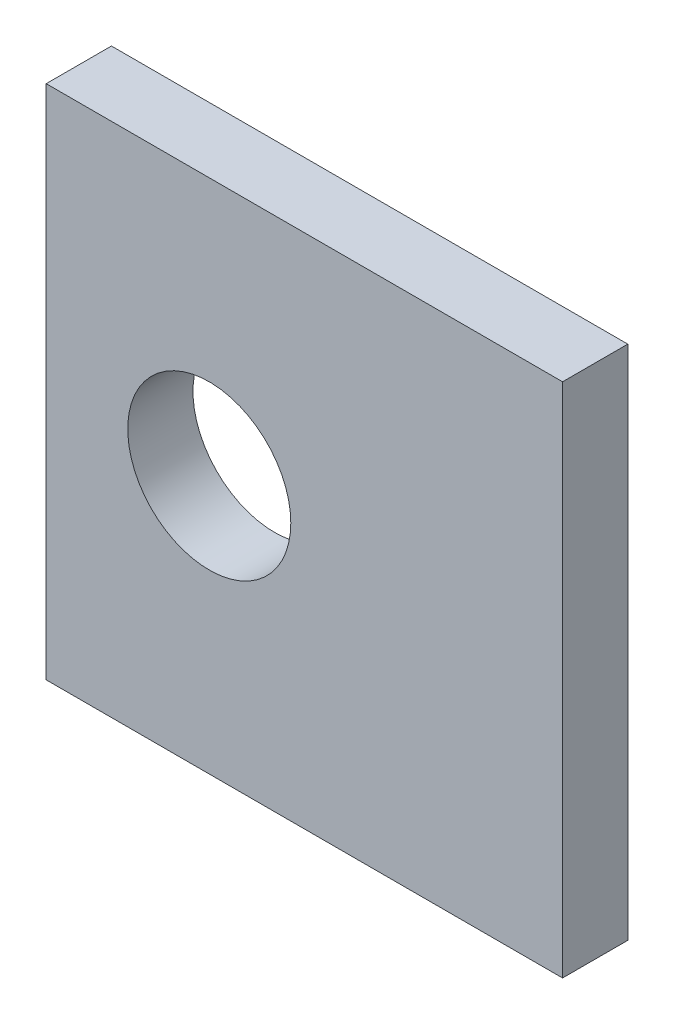
ISO-10303-21;
HEADER;
FILE_DESCRIPTION(('STEP AP214'),'2;1');
FILE_NAME('part.step','',(''),(''),'','','');
FILE_SCHEMA(('AUTOMOTIVE_DESIGN { 1 0 10303 214 1 1 1 1 }'));
ENDSEC;
DATA;
#1=APPLICATION_CONTEXT('core data for automotive mechanical design processes');
#2=APPLICATION_PROTOCOL_DEFINITION('international standard','automotive_design',2000,#1);
#3=PRODUCT_CONTEXT('',#1,'mechanical');
#4=PRODUCT('Part','Part','',(#3));
#5=PRODUCT_RELATED_PRODUCT_CATEGORY('part','',(#4));
#6=PRODUCT_DEFINITION_FORMATION('','',#4);
#7=PRODUCT_DEFINITION_CONTEXT('part definition',#1,'design');
#8=PRODUCT_DEFINITION('design','',#6,#7);
#9=PRODUCT_DEFINITION_SHAPE('','',#8);
#10=(LENGTH_UNIT() NAMED_UNIT(*) SI_UNIT(.MILLI.,.METRE.));
#11=(NAMED_UNIT(*) PLANE_ANGLE_UNIT() SI_UNIT($,.RADIAN.));
#12=(NAMED_UNIT(*) SI_UNIT($,.STERADIAN.) SOLID_ANGLE_UNIT());
#13=UNCERTAINTY_MEASURE_WITH_UNIT(LENGTH_MEASURE(1.E-05),#10,'distance_accuracy_value','');
#14=(GEOMETRIC_REPRESENTATION_CONTEXT(3) GLOBAL_UNCERTAINTY_ASSIGNED_CONTEXT((#13)) GLOBAL_UNIT_ASSIGNED_CONTEXT((#10,
#11,#12)) REPRESENTATION_CONTEXT('',''));
#15=CARTESIAN_POINT('',(0.,0.,0.));
#16=DIRECTION('',(0.,0.,1.));
#17=DIRECTION('',(1.,0.,0.));
#18=AXIS2_PLACEMENT_3D('',#15,#16,#17);
#19=CARTESIAN_POINT('',(19.,38.,2.4));
#20=DIRECTION('',(-1.,0.,0.));
#21=DIRECTION('',(0.,0.,1.));
#22=AXIS2_PLACEMENT_3D('',#19,#20,#21);
#23=PLANE('',#22);
#24=DIRECTION('',(0.,0.,-1.));
#25=VECTOR('',#24,1.);
#26=CARTESIAN_POINT('',(19.,0.,2.4));
#27=LINE('',#26,#25);
#28=CARTESIAN_POINT('',(19.,0.,2.4));
#29=VERTEX_POINT('',#28);
#30=CARTESIAN_POINT('',(19.,0.,-2.4));
#31=VERTEX_POINT('',#30);
#32=EDGE_CURVE('E96',#29,#31,#27,.T.);
#33=ORIENTED_EDGE('',*,*,#32,.T.);
#34=DIRECTION('',(0.,-1.,0.));
#35=VECTOR('',#34,1.);
#36=CARTESIAN_POINT('',(19.,38.,-2.4));
#37=LINE('',#36,#35);
#38=CARTESIAN_POINT('',(19.,38.,-2.4));
#39=VERTEX_POINT('',#38);
#40=EDGE_CURVE('E11',#39,#31,#37,.T.);
#41=ORIENTED_EDGE('',*,*,#40,.F.);
#42=DIRECTION('',(0.,0.,-1.));
#43=VECTOR('',#42,1.);
#44=CARTESIAN_POINT('',(19.,38.,2.4));
#45=LINE('',#44,#43);
#46=CARTESIAN_POINT('',(19.,38.,2.4));
#47=VERTEX_POINT('',#46);
#48=EDGE_CURVE('E84',#47,#39,#45,.T.);
#49=ORIENTED_EDGE('',*,*,#48,.F.);
#50=DIRECTION('',(0.,-1.,0.));
#51=VECTOR('',#50,1.);
#52=CARTESIAN_POINT('',(19.,38.,2.4));
#53=LINE('',#52,#51);
#54=EDGE_CURVE('E92',#47,#29,#53,.T.);
#55=ORIENTED_EDGE('',*,*,#54,.T.);
#56=EDGE_LOOP('',(#33,#41,#49,#55));
#57=FACE_BOUND('',#56,.T.);
#58=ADVANCED_FACE('F33',(#57),#23,.F.);
#59=CARTESIAN_POINT('',(-19.,38.,-2.4));
#60=DIRECTION('',(0.,0.,1.));
#61=DIRECTION('',(1.,0.,0.));
#62=AXIS2_PLACEMENT_3D('',#59,#60,#61);
#63=PLANE('',#62);
#64=CARTESIAN_POINT('',(-7.,19.,-2.4));
#65=DIRECTION('',(0.,0.,1.));
#66=DIRECTION('',(1.,0.,0.));
#67=AXIS2_PLACEMENT_3D('',#64,#65,#66);
#68=CIRCLE('',#67,6.);
#69=CARTESIAN_POINT('',(-0.999999999999998,19.,-2.4));
#70=VERTEX_POINT('',#69);
#71=EDGE_CURVE('E119',#70,#70,#68,.T.);
#72=ORIENTED_EDGE('',*,*,#71,.T.);
#73=EDGE_LOOP('',(#72));
#74=FACE_BOUND('',#73,.T.);
#75=DIRECTION('',(-1.,0.,0.));
#76=VECTOR('',#75,1.);
#77=CARTESIAN_POINT('',(-19.,0.,-2.4));
#78=LINE('',#77,#76);
#79=CARTESIAN_POINT('',(-19.,0.,-2.4));
#80=VERTEX_POINT('',#79);
#81=EDGE_CURVE('E88',#31,#80,#78,.T.);
#82=ORIENTED_EDGE('',*,*,#81,.T.);
#83=DIRECTION('',(0.,-1.,0.));
#84=VECTOR('',#83,1.);
#85=CARTESIAN_POINT('',(-19.,38.,-2.4));
#86=LINE('',#85,#84);
#87=CARTESIAN_POINT('',(-19.,38.,-2.4));
#88=VERTEX_POINT('',#87);
#89=EDGE_CURVE('E41',#88,#80,#86,.T.);
#90=ORIENTED_EDGE('',*,*,#89,.F.);
#91=DIRECTION('',(-1.,0.,0.));
#92=VECTOR('',#91,1.);
#93=CARTESIAN_POINT('',(-19.,38.,-2.4));
#94=LINE('',#93,#92);
#95=EDGE_CURVE('E79',#39,#88,#94,.T.);
#96=ORIENTED_EDGE('',*,*,#95,.F.);
#97=ORIENTED_EDGE('',*,*,#40,.T.);
#98=EDGE_LOOP('',(#82,#90,#96,#97));
#99=FACE_BOUND('',#98,.T.);
#100=ADVANCED_FACE('F87',(#74,#99),#63,.F.);
#101=CARTESIAN_POINT('',(-19.,38.,2.4));
#102=DIRECTION('',(1.,0.,0.));
#103=DIRECTION('',(0.,0.,-1.));
#104=AXIS2_PLACEMENT_3D('',#101,#102,#103);
#105=PLANE('',#104);
#106=DIRECTION('',(0.,0.,1.));
#107=VECTOR('',#106,1.);
#108=CARTESIAN_POINT('',(-19.,0.,2.4));
#109=LINE('',#108,#107);
#110=CARTESIAN_POINT('',(-19.,0.,2.4));
#111=VERTEX_POINT('',#110);
#112=EDGE_CURVE('E66',#80,#111,#109,.T.);
#113=ORIENTED_EDGE('',*,*,#112,.T.);
#114=DIRECTION('',(0.,-1.,0.));
#115=VECTOR('',#114,1.);
#116=CARTESIAN_POINT('',(-19.,38.,2.4));
#117=LINE('',#116,#115);
#118=CARTESIAN_POINT('',(-19.,38.,2.4));
#119=VERTEX_POINT('',#118);
#120=EDGE_CURVE('E89',#119,#111,#117,.T.);
#121=ORIENTED_EDGE('',*,*,#120,.F.);
#122=DIRECTION('',(0.,0.,1.));
#123=VECTOR('',#122,1.);
#124=CARTESIAN_POINT('',(-19.,38.,2.4));
#125=LINE('',#124,#123);
#126=EDGE_CURVE('E82',#88,#119,#125,.T.);
#127=ORIENTED_EDGE('',*,*,#126,.F.);
#128=ORIENTED_EDGE('',*,*,#89,.T.);
#129=EDGE_LOOP('',(#113,#121,#127,#128));
#130=FACE_BOUND('',#129,.T.);
#131=ADVANCED_FACE('F90',(#130),#105,.F.);
#132=CARTESIAN_POINT('',(-19.,38.,2.4));
#133=DIRECTION('',(0.,0.,-1.));
#134=DIRECTION('',(-1.,0.,0.));
#135=AXIS2_PLACEMENT_3D('',#132,#133,#134);
#136=PLANE('',#135);
#137=CARTESIAN_POINT('',(-7.,19.,2.4));
#138=DIRECTION('',(0.,0.,1.));
#139=DIRECTION('',(1.,0.,0.));
#140=AXIS2_PLACEMENT_3D('',#137,#138,#139);
#141=CIRCLE('',#140,6.);
#142=CARTESIAN_POINT('',(-0.999999999999998,19.,2.4));
#143=VERTEX_POINT('',#142);
#144=EDGE_CURVE('E122',#143,#143,#141,.T.);
#145=ORIENTED_EDGE('',*,*,#144,.F.);
#146=EDGE_LOOP('',(#145));
#147=FACE_BOUND('',#146,.T.);
#148=DIRECTION('',(1.,0.,0.));
#149=VECTOR('',#148,1.);
#150=CARTESIAN_POINT('',(-19.,0.,2.4));
#151=LINE('',#150,#149);
#152=EDGE_CURVE('E72',#111,#29,#151,.T.);
#153=ORIENTED_EDGE('',*,*,#152,.T.);
#154=ORIENTED_EDGE('',*,*,#54,.F.);
#155=DIRECTION('',(1.,0.,0.));
#156=VECTOR('',#155,1.);
#157=CARTESIAN_POINT('',(-19.,38.,2.4));
#158=LINE('',#157,#156);
#159=EDGE_CURVE('E49',#119,#47,#158,.T.);
#160=ORIENTED_EDGE('',*,*,#159,.F.);
#161=ORIENTED_EDGE('',*,*,#120,.T.);
#162=EDGE_LOOP('',(#153,#154,#160,#161));
#163=FACE_BOUND('',#162,.T.);
#164=ADVANCED_FACE('F104',(#147,#163),#136,.F.);
#165=CARTESIAN_POINT('',(0.,38.,0.));
#166=DIRECTION('',(0.,-1.,0.));
#167=DIRECTION('',(0.,0.,-1.));
#168=AXIS2_PLACEMENT_3D('',#165,#166,#167);
#169=PLANE('',#168);
#170=ORIENTED_EDGE('',*,*,#48,.T.);
#171=ORIENTED_EDGE('',*,*,#95,.T.);
#172=ORIENTED_EDGE('',*,*,#126,.T.);
#173=ORIENTED_EDGE('',*,*,#159,.T.);
#174=EDGE_LOOP('',(#170,#171,#172,#173));
#175=FACE_BOUND('',#174,.T.);
#176=ADVANCED_FACE('F80',(#175),#169,.F.);
#177=CARTESIAN_POINT('',(0.,0.,0.));
#178=DIRECTION('',(0.,-1.,0.));
#179=DIRECTION('',(0.,0.,-1.));
#180=AXIS2_PLACEMENT_3D('',#177,#178,#179);
#181=PLANE('',#180);
#182=CARTESIAN_POINT('',(-7.75,0.,0.));
#183=DIRECTION('',(0.,-1.,0.));
#184=DIRECTION('',(0.,0.,1.));
#185=AXIS2_PLACEMENT_3D('',#182,#183,#184);
#186=CIRCLE('',#185,2.);
#187=CARTESIAN_POINT('',(-7.75,0.,2.));
#188=VERTEX_POINT('',#187);
#189=EDGE_CURVE('E116',#188,#188,#186,.T.);
#190=ORIENTED_EDGE('',*,*,#189,.F.);
#191=EDGE_LOOP('',(#190));
#192=FACE_BOUND('',#191,.T.);
#193=CARTESIAN_POINT('',(7.75,0.,0.));
#194=DIRECTION('',(0.,-1.,0.));
#195=DIRECTION('',(0.,0.,-1.));
#196=AXIS2_PLACEMENT_3D('',#193,#194,#195);
#197=CIRCLE('',#196,2.);
#198=CARTESIAN_POINT('',(7.75,0.,-2.));
#199=VERTEX_POINT('',#198);
#200=EDGE_CURVE('E110',#199,#199,#197,.T.);
#201=ORIENTED_EDGE('',*,*,#200,.F.);
#202=EDGE_LOOP('',(#201));
#203=FACE_BOUND('',#202,.T.);
#204=ORIENTED_EDGE('',*,*,#32,.F.);
#205=ORIENTED_EDGE('',*,*,#152,.F.);
#206=ORIENTED_EDGE('',*,*,#112,.F.);
#207=ORIENTED_EDGE('',*,*,#81,.F.);
#208=EDGE_LOOP('',(#204,#205,#206,#207));
#209=FACE_BOUND('',#208,.T.);
#210=ADVANCED_FACE('F107',(#192,#203,#209),#181,.T.);
#211=CARTESIAN_POINT('',(7.75,10.,0.));
#212=DIRECTION('',(0.,-1.,0.));
#213=DIRECTION('',(0.,0.,-1.));
#214=AXIS2_PLACEMENT_3D('',#211,#212,#213);
#215=CYLINDRICAL_SURFACE('',#214,2.);
#216=CARTESIAN_POINT('',(7.75,10.,0.));
#217=DIRECTION('',(0.,-1.,0.));
#218=DIRECTION('',(0.,0.,-1.));
#219=AXIS2_PLACEMENT_3D('',#216,#217,#218);
#220=CIRCLE('',#219,2.);
#221=CARTESIAN_POINT('',(7.75,10.,-2.));
#222=VERTEX_POINT('',#221);
#223=EDGE_CURVE('E99',#222,#222,#220,.T.);
#224=ORIENTED_EDGE('',*,*,#223,.F.);
#225=EDGE_LOOP('',(#224));
#226=FACE_BOUND('',#225,.T.);
#227=ORIENTED_EDGE('',*,*,#200,.T.);
#228=EDGE_LOOP('',(#227));
#229=FACE_BOUND('',#228,.T.);
#230=ADVANCED_FACE('F174',(#226,#229),#215,.F.);
#231=CARTESIAN_POINT('',(7.75,10.,0.));
#232=DIRECTION('',(0.,-1.,0.));
#233=DIRECTION('',(0.,0.,-1.));
#234=AXIS2_PLACEMENT_3D('',#231,#232,#233);
#235=PLANE('',#234);
#236=ORIENTED_EDGE('',*,*,#223,.T.);
#237=EDGE_LOOP('',(#236));
#238=FACE_BOUND('',#237,.T.);
#239=ADVANCED_FACE('F183',(#238),#235,.T.);
#240=CARTESIAN_POINT('',(-7.75,10.,0.));
#241=DIRECTION('',(0.,-1.,0.));
#242=DIRECTION('',(0.,0.,-1.));
#243=AXIS2_PLACEMENT_3D('',#240,#241,#242);
#244=CYLINDRICAL_SURFACE('',#243,2.);
#245=CARTESIAN_POINT('',(-7.75,10.,0.));
#246=DIRECTION('',(0.,-1.,0.));
#247=DIRECTION('',(0.,0.,1.));
#248=AXIS2_PLACEMENT_3D('',#245,#246,#247);
#249=CIRCLE('',#248,2.);
#250=CARTESIAN_POINT('',(-7.75,10.,2.));
#251=VERTEX_POINT('',#250);
#252=EDGE_CURVE('E113',#251,#251,#249,.T.);
#253=ORIENTED_EDGE('',*,*,#252,.F.);
#254=EDGE_LOOP('',(#253));
#255=FACE_BOUND('',#254,.T.);
#256=ORIENTED_EDGE('',*,*,#189,.T.);
#257=EDGE_LOOP('',(#256));
#258=FACE_BOUND('',#257,.T.);
#259=ADVANCED_FACE('F193',(#255,#258),#244,.F.);
#260=CARTESIAN_POINT('',(-7.75,10.,0.));
#261=DIRECTION('',(0.,1.,0.));
#262=DIRECTION('',(0.,0.,1.));
#263=AXIS2_PLACEMENT_3D('',#260,#261,#262);
#264=PLANE('',#263);
#265=ORIENTED_EDGE('',*,*,#252,.T.);
#266=EDGE_LOOP('',(#265));
#267=FACE_BOUND('',#266,.T.);
#268=ADVANCED_FACE('F132',(#267),#264,.F.);
#269=CARTESIAN_POINT('',(-7.,19.,-2.4));
#270=DIRECTION('',(0.,0.,1.));
#271=DIRECTION('',(1.,0.,0.));
#272=AXIS2_PLACEMENT_3D('',#269,#270,#271);
#273=CYLINDRICAL_SURFACE('',#272,6.);
#274=ORIENTED_EDGE('',*,*,#71,.F.);
#275=EDGE_LOOP('',(#274));
#276=FACE_BOUND('',#275,.T.);
#277=ORIENTED_EDGE('',*,*,#144,.T.);
#278=EDGE_LOOP('',(#277));
#279=FACE_BOUND('',#278,.T.);
#280=ADVANCED_FACE('F129',(#276,#279),#273,.F.);
#281=CLOSED_SHELL('',(#58,#100,#131,#164,#176,#210,#230,#239,#259,#268,#280));
#282=MANIFOLD_SOLID_BREP('B2',#281);
#283=ADVANCED_BREP_SHAPE_REPRESENTATION('',(#18,#282),#14);
#284=SHAPE_DEFINITION_REPRESENTATION(#9,#283);
ENDSEC;
END-ISO-10303-21;
